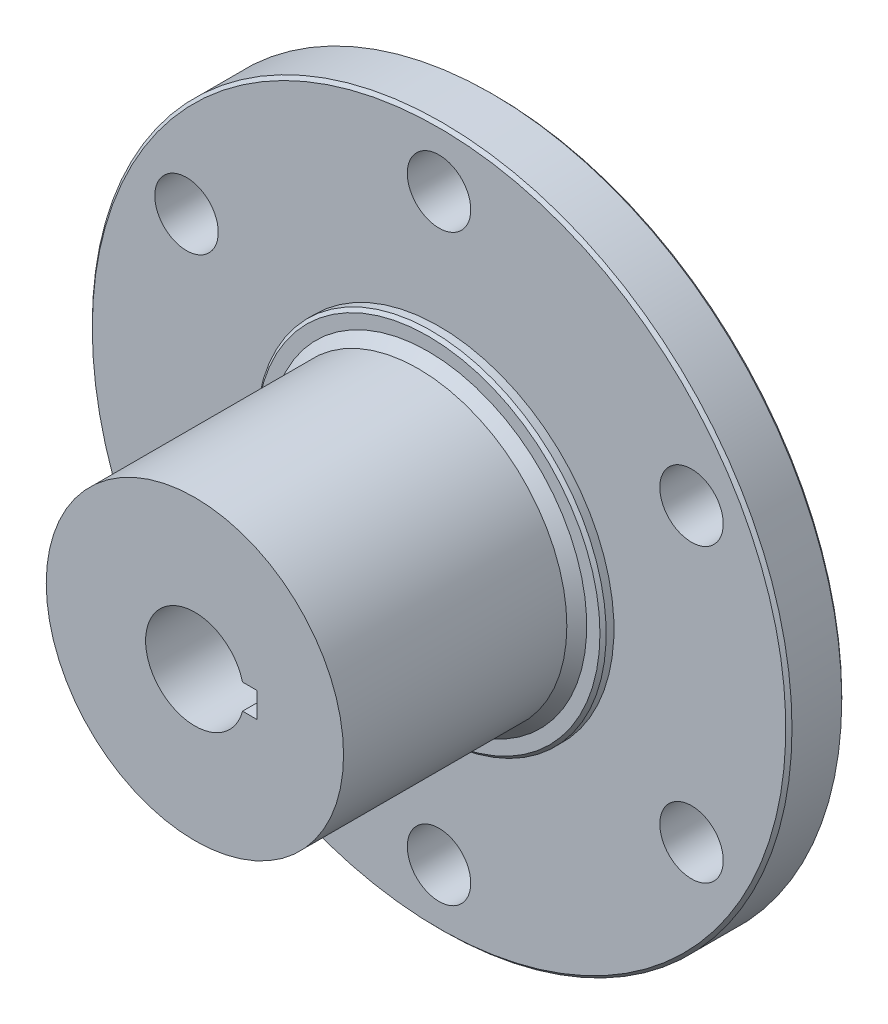
ISO-10303-21;
HEADER;
FILE_DESCRIPTION(('STEP AP214'),'2;1');
FILE_NAME('part.step','',(''),(''),'','','');
FILE_SCHEMA(('AUTOMOTIVE_DESIGN { 1 0 10303 214 1 1 1 1 }'));
ENDSEC;
DATA;
#1=APPLICATION_CONTEXT('core data for automotive mechanical design processes');
#2=APPLICATION_PROTOCOL_DEFINITION('international standard','automotive_design',2000,#1);
#3=PRODUCT_CONTEXT('',#1,'mechanical');
#4=PRODUCT('Part','Part','',(#3));
#5=PRODUCT_RELATED_PRODUCT_CATEGORY('part','',(#4));
#6=PRODUCT_DEFINITION_FORMATION('','',#4);
#7=PRODUCT_DEFINITION_CONTEXT('part definition',#1,'design');
#8=PRODUCT_DEFINITION('design','',#6,#7);
#9=PRODUCT_DEFINITION_SHAPE('','',#8);
#10=(LENGTH_UNIT() NAMED_UNIT(*) SI_UNIT(.MILLI.,.METRE.));
#11=(NAMED_UNIT(*) PLANE_ANGLE_UNIT() SI_UNIT($,.RADIAN.));
#12=(NAMED_UNIT(*) SI_UNIT($,.STERADIAN.) SOLID_ANGLE_UNIT());
#13=UNCERTAINTY_MEASURE_WITH_UNIT(LENGTH_MEASURE(1.E-05),#10,'distance_accuracy_value','');
#14=(GEOMETRIC_REPRESENTATION_CONTEXT(3) GLOBAL_UNCERTAINTY_ASSIGNED_CONTEXT((#13)) GLOBAL_UNIT_ASSIGNED_CONTEXT((#10,
#11,#12)) REPRESENTATION_CONTEXT('',''));
#15=CARTESIAN_POINT('',(0.,0.,0.));
#16=DIRECTION('',(0.,0.,1.));
#17=DIRECTION('',(1.,0.,0.));
#18=AXIS2_PLACEMENT_3D('',#15,#16,#17);
#19=CARTESIAN_POINT('',(3.89225476041844,-1.0287,0.));
#20=DIRECTION('',(0.,-1.,0.));
#21=DIRECTION('',(1.,0.,0.));
#22=AXIS2_PLACEMENT_3D('',#19,#20,#21);
#23=PLANE('',#22);
#24=DIRECTION('',(0.,0.,-1.));
#25=VECTOR('',#24,1.);
#26=CARTESIAN_POINT('',(5.0546,-1.0287,0.));
#27=LINE('',#26,#25);
#28=CARTESIAN_POINT('',(5.0546,-1.0287,25.4));
#29=VERTEX_POINT('',#28);
#30=CARTESIAN_POINT('',(5.0546,-1.0287,0.));
#31=VERTEX_POINT('',#30);
#32=EDGE_CURVE('E77',#29,#31,#27,.T.);
#33=ORIENTED_EDGE('',*,*,#32,.T.);
#34=DIRECTION('',(1.,0.,0.));
#35=VECTOR('',#34,1.);
#36=CARTESIAN_POINT('',(3.89225476041844,-1.0287,0.));
#37=LINE('',#36,#35);
#38=CARTESIAN_POINT('',(3.89225476041844,-1.0287,0.));
#39=VERTEX_POINT('',#38);
#40=EDGE_CURVE('E34',#39,#31,#37,.T.);
#41=ORIENTED_EDGE('',*,*,#40,.F.);
#42=DIRECTION('',(0.,0.,1.));
#43=VECTOR('',#42,1.);
#44=CARTESIAN_POINT('',(3.89225476041844,-1.0287,0.));
#45=LINE('',#44,#43);
#46=CARTESIAN_POINT('',(3.89225476041844,-1.0287,25.4));
#47=VERTEX_POINT('',#46);
#48=EDGE_CURVE('E66',#39,#47,#45,.T.);
#49=ORIENTED_EDGE('',*,*,#48,.T.);
#50=DIRECTION('',(1.,0.,0.));
#51=VECTOR('',#50,1.);
#52=CARTESIAN_POINT('',(0.,-1.0287,25.4));
#53=LINE('',#52,#51);
#54=EDGE_CURVE('E52',#29,#47,#53,.F.);
#55=ORIENTED_EDGE('',*,*,#54,.F.);
#56=EDGE_LOOP('',(#33,#41,#49,#55));
#57=FACE_BOUND('',#56,.T.);
#58=ADVANCED_FACE('F16',(#57),#23,.F.);
#59=CARTESIAN_POINT('',(3.89225476041844,1.0287,0.));
#60=DIRECTION('',(0.,1.,0.));
#61=DIRECTION('',(0.,0.,1.));
#62=AXIS2_PLACEMENT_3D('',#59,#60,#61);
#63=PLANE('',#62);
#64=DIRECTION('',(0.,0.,1.));
#65=VECTOR('',#64,1.);
#66=CARTESIAN_POINT('',(3.89225476041844,1.0287,0.));
#67=LINE('',#66,#65);
#68=CARTESIAN_POINT('',(3.89225476041844,1.0287,25.4));
#69=VERTEX_POINT('',#68);
#70=CARTESIAN_POINT('',(3.89225476041844,1.0287,0.));
#71=VERTEX_POINT('',#70);
#72=EDGE_CURVE('E59',#69,#71,#67,.F.);
#73=ORIENTED_EDGE('',*,*,#72,.T.);
#74=DIRECTION('',(1.,0.,0.));
#75=VECTOR('',#74,1.);
#76=CARTESIAN_POINT('',(3.89225476041844,1.0287,0.));
#77=LINE('',#76,#75);
#78=CARTESIAN_POINT('',(5.0546,1.0287,0.));
#79=VERTEX_POINT('',#78);
#80=EDGE_CURVE('E84',#79,#71,#77,.F.);
#81=ORIENTED_EDGE('',*,*,#80,.F.);
#82=DIRECTION('',(0.,0.,-1.));
#83=VECTOR('',#82,1.);
#84=CARTESIAN_POINT('',(5.0546,1.0287,0.));
#85=LINE('',#84,#83);
#86=CARTESIAN_POINT('',(5.0546,1.0287,25.4));
#87=VERTEX_POINT('',#86);
#88=EDGE_CURVE('E73',#79,#87,#85,.F.);
#89=ORIENTED_EDGE('',*,*,#88,.T.);
#90=DIRECTION('',(1.,0.,0.));
#91=VECTOR('',#90,1.);
#92=CARTESIAN_POINT('',(0.,1.0287,25.4));
#93=LINE('',#92,#91);
#94=EDGE_CURVE('E67',#69,#87,#93,.T.);
#95=ORIENTED_EDGE('',*,*,#94,.F.);
#96=EDGE_LOOP('',(#73,#81,#89,#95));
#97=FACE_BOUND('',#96,.T.);
#98=ADVANCED_FACE('F71',(#97),#63,.F.);
#99=CARTESIAN_POINT('',(0.,0.,25.4));
#100=DIRECTION('',(0.,0.,1.));
#101=DIRECTION('',(1.,0.,0.));
#102=AXIS2_PLACEMENT_3D('',#99,#100,#101);
#103=PLANE('',#102);
#104=CARTESIAN_POINT('',(0.,0.,25.4));
#105=DIRECTION('',(0.,0.,-1.));
#106=DIRECTION('',(-1.,0.,0.));
#107=AXIS2_PLACEMENT_3D('',#104,#105,#106);
#108=CIRCLE('',#107,12.1412);
#109=CARTESIAN_POINT('',(-12.1412,0.,25.4));
#110=VERTEX_POINT('',#109);
#111=EDGE_CURVE('E89',#110,#110,#108,.T.);
#112=ORIENTED_EDGE('',*,*,#111,.F.);
#113=EDGE_LOOP('',(#112));
#114=FACE_BOUND('',#113,.T.);
#115=CARTESIAN_POINT('',(0.,0.,25.4));
#116=DIRECTION('',(0.,0.,1.));
#117=DIRECTION('',(1.,0.,0.));
#118=AXIS2_PLACEMENT_3D('',#115,#116,#117);
#119=CIRCLE('',#118,4.0259);
#120=EDGE_CURVE('E19',#47,#69,#119,.F.);
#121=ORIENTED_EDGE('',*,*,#120,.T.);
#122=ORIENTED_EDGE('',*,*,#94,.T.);
#123=DIRECTION('',(0.,1.,0.));
#124=VECTOR('',#123,1.);
#125=CARTESIAN_POINT('',(5.0546,1.0287,25.4));
#126=LINE('',#125,#124);
#127=EDGE_CURVE('E87',#87,#29,#126,.F.);
#128=ORIENTED_EDGE('',*,*,#127,.T.);
#129=ORIENTED_EDGE('',*,*,#54,.T.);
#130=EDGE_LOOP('',(#121,#122,#128,#129));
#131=FACE_BOUND('',#130,.T.);
#132=ADVANCED_FACE('F76',(#114,#131),#103,.T.);
#133=CARTESIAN_POINT('',(0.,0.,0.));
#134=DIRECTION('',(0.,0.,1.));
#135=DIRECTION('',(1.,0.,0.));
#136=AXIS2_PLACEMENT_3D('',#133,#134,#135);
#137=CYLINDRICAL_SURFACE('',#136,4.0259);
#138=ORIENTED_EDGE('',*,*,#48,.F.);
#139=CARTESIAN_POINT('',(0.,0.,0.));
#140=DIRECTION('',(0.,0.,1.));
#141=DIRECTION('',(1.,0.,0.));
#142=AXIS2_PLACEMENT_3D('',#139,#140,#141);
#143=CIRCLE('',#142,4.0259);
#144=EDGE_CURVE('E64',#39,#71,#143,.F.);
#145=ORIENTED_EDGE('',*,*,#144,.T.);
#146=ORIENTED_EDGE('',*,*,#72,.F.);
#147=ORIENTED_EDGE('',*,*,#120,.F.);
#148=EDGE_LOOP('',(#138,#145,#146,#147));
#149=FACE_BOUND('',#148,.T.);
#150=ADVANCED_FACE('F62',(#149),#137,.F.);
#151=CARTESIAN_POINT('',(5.0546,1.0287,0.));
#152=DIRECTION('',(1.,0.,0.));
#153=DIRECTION('',(0.,0.,-1.));
#154=AXIS2_PLACEMENT_3D('',#151,#152,#153);
#155=PLANE('',#154);
#156=ORIENTED_EDGE('',*,*,#88,.F.);
#157=DIRECTION('',(0.,1.,0.));
#158=VECTOR('',#157,1.);
#159=CARTESIAN_POINT('',(5.0546,0.,0.));
#160=LINE('',#159,#158);
#161=EDGE_CURVE('E91',#79,#31,#160,.F.);
#162=ORIENTED_EDGE('',*,*,#161,.T.);
#163=ORIENTED_EDGE('',*,*,#32,.F.);
#164=ORIENTED_EDGE('',*,*,#127,.F.);
#165=EDGE_LOOP('',(#156,#162,#163,#164));
#166=FACE_BOUND('',#165,.T.);
#167=ADVANCED_FACE('F165',(#166),#155,.F.);
#168=CARTESIAN_POINT('',(0.,0.,25.4));
#169=DIRECTION('',(0.,0.,-1.));
#170=DIRECTION('',(-1.,0.,0.));
#171=AXIS2_PLACEMENT_3D('',#168,#169,#170);
#172=CYLINDRICAL_SURFACE('',#171,12.1412);
#173=ORIENTED_EDGE('',*,*,#111,.T.);
#174=EDGE_LOOP('',(#173));
#175=FACE_BOUND('',#174,.T.);
#176=CARTESIAN_POINT('',(0.,0.,7.16280000000005));
#177=DIRECTION('',(0.,0.,-1.));
#178=DIRECTION('',(-1.,0.,0.));
#179=AXIS2_PLACEMENT_3D('',#176,#177,#178);
#180=CIRCLE('',#179,12.1412);
#181=CARTESIAN_POINT('',(-12.1412,0.,7.16280000000005));
#182=VERTEX_POINT('',#181);
#183=EDGE_CURVE('E93',#182,#182,#180,.T.);
#184=ORIENTED_EDGE('',*,*,#183,.F.);
#185=EDGE_LOOP('',(#184));
#186=FACE_BOUND('',#185,.T.);
#187=ADVANCED_FACE('F155',(#175,#186),#172,.T.);
#188=CARTESIAN_POINT('',(0.,0.,0.));
#189=DIRECTION('',(0.,0.,1.));
#190=DIRECTION('',(1.,0.,0.));
#191=AXIS2_PLACEMENT_3D('',#188,#189,#190);
#192=PLANE('',#191);
#193=ORIENTED_EDGE('',*,*,#161,.F.);
#194=ORIENTED_EDGE('',*,*,#80,.T.);
#195=ORIENTED_EDGE('',*,*,#144,.F.);
#196=ORIENTED_EDGE('',*,*,#40,.T.);
#197=EDGE_LOOP('',(#193,#194,#195,#196));
#198=FACE_BOUND('',#197,.T.);
#199=CARTESIAN_POINT('',(0.,0.,0.));
#200=DIRECTION('',(0.,0.,1.));
#201=DIRECTION('',(0.,-1.,0.));
#202=AXIS2_PLACEMENT_3D('',#199,#200,#201);
#203=CIRCLE('',#202,14.1003226197908);
#204=CARTESIAN_POINT('',(0.,-14.1003226197908,0.));
#205=VERTEX_POINT('',#204);
#206=EDGE_CURVE('E149',#205,#205,#203,.T.);
#207=ORIENTED_EDGE('',*,*,#206,.F.);
#208=EDGE_LOOP('',(#207));
#209=FACE_BOUND('',#208,.T.);
#210=ADVANCED_FACE('F239',(#198,#209),#192,.F.);
#211=CARTESIAN_POINT('',(0.,0.,6.35));
#212=DIRECTION('',(0.,0.,-1.));
#213=DIRECTION('',(0.,1.,0.));
#214=AXIS2_PLACEMENT_3D('',#211,#212,#213);
#215=CONICAL_SURFACE('',#214,12.954,0.785398163397445);
#216=ORIENTED_EDGE('',*,*,#183,.T.);
#217=EDGE_LOOP('',(#216));
#218=FACE_BOUND('',#217,.T.);
#219=CARTESIAN_POINT('',(0.,0.,6.35));
#220=DIRECTION('',(0.,0.,-1.));
#221=DIRECTION('',(0.,1.,0.));
#222=AXIS2_PLACEMENT_3D('',#219,#220,#221);
#223=CIRCLE('',#222,12.954);
#224=CARTESIAN_POINT('',(0.,12.954,6.35));
#225=VERTEX_POINT('',#224);
#226=EDGE_CURVE('E145',#225,#225,#223,.T.);
#227=ORIENTED_EDGE('',*,*,#226,.F.);
#228=EDGE_LOOP('',(#227));
#229=FACE_BOUND('',#228,.T.);
#230=ADVANCED_FACE('F235',(#218,#229),#215,.T.);
#231=CARTESIAN_POINT('',(0.,0.,0.254000000000009));
#232=DIRECTION('',(0.,0.,1.));
#233=DIRECTION('',(0.,-1.,0.));
#234=AXIS2_PLACEMENT_3D('',#231,#232,#233);
#235=CONICAL_SURFACE('',#234,14.3543226197908,0.785398163397449);
#236=ORIENTED_EDGE('',*,*,#206,.T.);
#237=EDGE_LOOP('',(#236));
#238=FACE_BOUND('',#237,.T.);
#239=CARTESIAN_POINT('',(0.,0.,0.254000000000009));
#240=DIRECTION('',(0.,0.,-1.));
#241=DIRECTION('',(-1.,0.,0.));
#242=AXIS2_PLACEMENT_3D('',#239,#240,#241);
#243=CIRCLE('',#242,14.3543226197908);
#244=CARTESIAN_POINT('',(-14.3543226197908,0.,0.254000000000009));
#245=VERTEX_POINT('',#244);
#246=EDGE_CURVE('E148',#245,#245,#243,.F.);
#247=ORIENTED_EDGE('',*,*,#246,.F.);
#248=EDGE_LOOP('',(#247));
#249=FACE_BOUND('',#248,.T.);
#250=ADVANCED_FACE('F231',(#238,#249),#235,.T.);
#251=CARTESIAN_POINT('',(0.,0.,6.35));
#252=DIRECTION('',(0.,0.,1.));
#253=DIRECTION('',(1.,0.,0.));
#254=AXIS2_PLACEMENT_3D('',#251,#252,#253);
#255=PLANE('',#254);
#256=CARTESIAN_POINT('',(0.,0.,6.35));
#257=DIRECTION('',(0.,0.,-1.));
#258=DIRECTION('',(-1.,0.,0.));
#259=AXIS2_PLACEMENT_3D('',#256,#257,#258);
#260=CIRCLE('',#259,14.0335);
#261=CARTESIAN_POINT('',(-14.0335,0.,6.35));
#262=VERTEX_POINT('',#261);
#263=EDGE_CURVE('E141',#262,#262,#260,.T.);
#264=ORIENTED_EDGE('',*,*,#263,.F.);
#265=EDGE_LOOP('',(#264));
#266=FACE_BOUND('',#265,.T.);
#267=ORIENTED_EDGE('',*,*,#226,.T.);
#268=EDGE_LOOP('',(#267));
#269=FACE_BOUND('',#268,.T.);
#270=ADVANCED_FACE('F227',(#266,#269),#255,.T.);
#271=CARTESIAN_POINT('',(0.,0.,1.143));
#272=DIRECTION('',(0.,0.,1.));
#273=DIRECTION('',(1.,0.,0.));
#274=AXIS2_PLACEMENT_3D('',#271,#272,#273);
#275=CONICAL_SURFACE('',#274,28.575,0.785398163397457);
#276=CARTESIAN_POINT('',(0.,0.,1.14299999999999));
#277=DIRECTION('',(0.,0.,-1.));
#278=DIRECTION('',(-1.,0.,0.));
#279=AXIS2_PLACEMENT_3D('',#276,#277,#278);
#280=CIRCLE('',#279,28.575);
#281=CARTESIAN_POINT('',(-28.575,0.,1.14299999999999));
#282=VERTEX_POINT('',#281);
#283=EDGE_CURVE('E144',#282,#282,#280,.F.);
#284=ORIENTED_EDGE('',*,*,#283,.F.);
#285=EDGE_LOOP('',(#284));
#286=FACE_BOUND('',#285,.T.);
#287=CARTESIAN_POINT('',(0.,0.,0.889000000000003));
#288=DIRECTION('',(0.,0.,1.));
#289=DIRECTION('',(1.,0.,0.));
#290=AXIS2_PLACEMENT_3D('',#287,#288,#289);
#291=CIRCLE('',#290,28.321);
#292=CARTESIAN_POINT('',(28.321,0.,0.889000000000003));
#293=VERTEX_POINT('',#292);
#294=EDGE_CURVE('E138',#293,#293,#291,.F.);
#295=ORIENTED_EDGE('',*,*,#294,.F.);
#296=EDGE_LOOP('',(#295));
#297=FACE_BOUND('',#296,.T.);
#298=ADVANCED_FACE('F223',(#286,#297),#275,.T.);
#299=CARTESIAN_POINT('',(0.,0.,0.));
#300=DIRECTION('',(0.,0.,-1.));
#301=DIRECTION('',(-1.,0.,0.));
#302=AXIS2_PLACEMENT_3D('',#299,#300,#301);
#303=CYLINDRICAL_SURFACE('',#302,14.3543226197908);
#304=CARTESIAN_POINT('',(0.,0.,0.889000000000001));
#305=DIRECTION('',(0.,0.,-1.));
#306=DIRECTION('',(-1.,0.,0.));
#307=AXIS2_PLACEMENT_3D('',#304,#305,#306);
#308=CIRCLE('',#307,14.3543226197908);
#309=CARTESIAN_POINT('',(-14.3543226197908,0.,0.889000000000001));
#310=VERTEX_POINT('',#309);
#311=EDGE_CURVE('E135',#310,#310,#308,.F.);
#312=ORIENTED_EDGE('',*,*,#311,.F.);
#313=EDGE_LOOP('',(#312));
#314=FACE_BOUND('',#313,.T.);
#315=ORIENTED_EDGE('',*,*,#246,.T.);
#316=EDGE_LOOP('',(#315));
#317=FACE_BOUND('',#316,.T.);
#318=ADVANCED_FACE('F219',(#314,#317),#303,.T.);
#319=CARTESIAN_POINT('',(0.,0.,6.35));
#320=DIRECTION('',(0.,0.,-1.));
#321=DIRECTION('',(-1.,0.,0.));
#322=AXIS2_PLACEMENT_3D('',#319,#320,#321);
#323=CYLINDRICAL_SURFACE('',#322,28.575);
#324=CARTESIAN_POINT('',(0.,0.,5.20699999999999));
#325=DIRECTION('',(0.,0.,-1.));
#326=DIRECTION('',(-1.,0.,0.));
#327=AXIS2_PLACEMENT_3D('',#324,#325,#326);
#328=CIRCLE('',#327,28.575);
#329=CARTESIAN_POINT('',(-28.575,0.,5.20699999999999));
#330=VERTEX_POINT('',#329);
#331=EDGE_CURVE('E134',#330,#330,#328,.F.);
#332=ORIENTED_EDGE('',*,*,#331,.F.);
#333=EDGE_LOOP('',(#332));
#334=FACE_BOUND('',#333,.T.);
#335=ORIENTED_EDGE('',*,*,#283,.T.);
#336=EDGE_LOOP('',(#335));
#337=FACE_BOUND('',#336,.T.);
#338=ADVANCED_FACE('F215',(#334,#337),#323,.T.);
#339=CARTESIAN_POINT('',(0.,0.,6.09599999999999));
#340=DIRECTION('',(0.,0.,-1.));
#341=DIRECTION('',(-1.,0.,0.));
#342=AXIS2_PLACEMENT_3D('',#339,#340,#341);
#343=CONICAL_SURFACE('',#342,14.2875,0.785398163397421);
#344=CARTESIAN_POINT('',(0.,0.,6.09599999999999));
#345=DIRECTION('',(0.,0.,-1.));
#346=DIRECTION('',(-1.,0.,0.));
#347=AXIS2_PLACEMENT_3D('',#344,#345,#346);
#348=CIRCLE('',#347,14.2875);
#349=CARTESIAN_POINT('',(-14.2875,0.,6.09599999999999));
#350=VERTEX_POINT('',#349);
#351=EDGE_CURVE('E124',#350,#350,#348,.T.);
#352=ORIENTED_EDGE('',*,*,#351,.F.);
#353=EDGE_LOOP('',(#352));
#354=FACE_BOUND('',#353,.T.);
#355=ORIENTED_EDGE('',*,*,#263,.T.);
#356=EDGE_LOOP('',(#355));
#357=FACE_BOUND('',#356,.T.);
#358=ADVANCED_FACE('F211',(#354,#357),#343,.T.);
#359=CARTESIAN_POINT('',(-62.1712615480534,0.,0.889000000000003));
#360=DIRECTION('',(0.,0.,-1.));
#361=DIRECTION('',(-1.,0.,0.));
#362=AXIS2_PLACEMENT_3D('',#359,#360,#361);
#363=PLANE('',#362);
#364=CARTESIAN_POINT('',(-20.622229927617,11.90625,0.889000000000001));
#365=DIRECTION('',(0.,0.,1.));
#366=DIRECTION('',(1.,0.,0.));
#367=AXIS2_PLACEMENT_3D('',#364,#365,#366);
#368=CIRCLE('',#367,2.5908);
#369=CARTESIAN_POINT('',(-18.031429927617,11.90625,0.889000000000001));
#370=VERTEX_POINT('',#369);
#371=EDGE_CURVE('E115',#370,#370,#368,.T.);
#372=ORIENTED_EDGE('',*,*,#371,.T.);
#373=EDGE_LOOP('',(#372));
#374=FACE_BOUND('',#373,.T.);
#375=CARTESIAN_POINT('',(0.,-23.8125,0.889000000000003));
#376=DIRECTION('',(0.,0.,1.));
#377=DIRECTION('',(1.,0.,0.));
#378=AXIS2_PLACEMENT_3D('',#375,#376,#377);
#379=CIRCLE('',#378,2.5908);
#380=CARTESIAN_POINT('',(2.5908,-23.8125,0.889000000000003));
#381=VERTEX_POINT('',#380);
#382=EDGE_CURVE('E118',#381,#381,#379,.T.);
#383=ORIENTED_EDGE('',*,*,#382,.T.);
#384=EDGE_LOOP('',(#383));
#385=FACE_BOUND('',#384,.T.);
#386=CARTESIAN_POINT('',(20.6222299276168,11.9062500000002,0.889000000000004));
#387=DIRECTION('',(0.,0.,1.));
#388=DIRECTION('',(1.,0.,0.));
#389=AXIS2_PLACEMENT_3D('',#386,#387,#388);
#390=CIRCLE('',#389,2.5908);
#391=CARTESIAN_POINT('',(23.2130299276168,11.9062500000002,0.889000000000004));
#392=VERTEX_POINT('',#391);
#393=EDGE_CURVE('E121',#392,#392,#390,.T.);
#394=ORIENTED_EDGE('',*,*,#393,.T.);
#395=EDGE_LOOP('',(#394));
#396=FACE_BOUND('',#395,.T.);
#397=ORIENTED_EDGE('',*,*,#311,.T.);
#398=EDGE_LOOP('',(#397));
#399=FACE_BOUND('',#398,.T.);
#400=CARTESIAN_POINT('',(20.6222299276171,-11.9062499999998,0.889000000000004));
#401=DIRECTION('',(0.,0.,1.));
#402=DIRECTION('',(1.,0.,0.));
#403=AXIS2_PLACEMENT_3D('',#400,#401,#402);
#404=CIRCLE('',#403,2.5908);
#405=CARTESIAN_POINT('',(23.2130299276171,-11.9062499999998,0.889000000000004));
#406=VERTEX_POINT('',#405);
#407=EDGE_CURVE('E125',#406,#406,#404,.T.);
#408=ORIENTED_EDGE('',*,*,#407,.T.);
#409=EDGE_LOOP('',(#408));
#410=FACE_BOUND('',#409,.T.);
#411=CARTESIAN_POINT('',(-20.6222299276169,-11.9062500000001,0.889000000000001));
#412=DIRECTION('',(0.,0.,1.));
#413=DIRECTION('',(1.,0.,0.));
#414=AXIS2_PLACEMENT_3D('',#411,#412,#413);
#415=CIRCLE('',#414,2.5908);
#416=CARTESIAN_POINT('',(-18.0314299276169,-11.9062500000001,0.889000000000001));
#417=VERTEX_POINT('',#416);
#418=EDGE_CURVE('E128',#417,#417,#415,.T.);
#419=ORIENTED_EDGE('',*,*,#418,.T.);
#420=EDGE_LOOP('',(#419));
#421=FACE_BOUND('',#420,.T.);
#422=CARTESIAN_POINT('',(0.,23.8125,0.889000000000003));
#423=DIRECTION('',(0.,0.,1.));
#424=DIRECTION('',(1.,0.,0.));
#425=AXIS2_PLACEMENT_3D('',#422,#423,#424);
#426=CIRCLE('',#425,2.5908);
#427=CARTESIAN_POINT('',(2.5908,23.8125,0.889000000000003));
#428=VERTEX_POINT('',#427);
#429=EDGE_CURVE('E131',#428,#428,#426,.T.);
#430=ORIENTED_EDGE('',*,*,#429,.T.);
#431=EDGE_LOOP('',(#430));
#432=FACE_BOUND('',#431,.T.);
#433=ORIENTED_EDGE('',*,*,#294,.T.);
#434=EDGE_LOOP('',(#433));
#435=FACE_BOUND('',#434,.T.);
#436=ADVANCED_FACE('F207',(#374,#385,#396,#399,#410,#421,#432,#435),#363,.T.);
#437=CARTESIAN_POINT('',(0.,0.,5.20699999999999));
#438=DIRECTION('',(0.,0.,-1.));
#439=DIRECTION('',(-1.,0.,0.));
#440=AXIS2_PLACEMENT_3D('',#437,#438,#439);
#441=CONICAL_SURFACE('',#440,28.575,0.785398163397457);
#442=CARTESIAN_POINT('',(0.,0.,5.461));
#443=DIRECTION('',(0.,0.,-1.));
#444=DIRECTION('',(-1.,0.,0.));
#445=AXIS2_PLACEMENT_3D('',#442,#443,#444);
#446=CIRCLE('',#445,28.321);
#447=CARTESIAN_POINT('',(-28.321,0.,5.461));
#448=VERTEX_POINT('',#447);
#449=EDGE_CURVE('E112',#448,#448,#446,.T.);
#450=ORIENTED_EDGE('',*,*,#449,.T.);
#451=EDGE_LOOP('',(#450));
#452=FACE_BOUND('',#451,.T.);
#453=ORIENTED_EDGE('',*,*,#331,.T.);
#454=EDGE_LOOP('',(#453));
#455=FACE_BOUND('',#454,.T.);
#456=ADVANCED_FACE('F203',(#452,#455),#441,.T.);
#457=CARTESIAN_POINT('',(0.,23.8125,0.));
#458=DIRECTION('',(0.,0.,1.));
#459=DIRECTION('',(1.,0.,0.));
#460=AXIS2_PLACEMENT_3D('',#457,#458,#459);
#461=CYLINDRICAL_SURFACE('',#460,2.5908);
#462=ORIENTED_EDGE('',*,*,#429,.F.);
#463=EDGE_LOOP('',(#462));
#464=FACE_BOUND('',#463,.T.);
#465=CARTESIAN_POINT('',(0.,23.8125,5.461));
#466=DIRECTION('',(0.,0.,1.));
#467=DIRECTION('',(1.,0.,0.));
#468=AXIS2_PLACEMENT_3D('',#465,#466,#467);
#469=CIRCLE('',#468,2.5908);
#470=CARTESIAN_POINT('',(2.5908,23.8125,5.461));
#471=VERTEX_POINT('',#470);
#472=EDGE_CURVE('E109',#471,#471,#469,.T.);
#473=ORIENTED_EDGE('',*,*,#472,.T.);
#474=EDGE_LOOP('',(#473));
#475=FACE_BOUND('',#474,.T.);
#476=ADVANCED_FACE('F199',(#464,#475),#461,.F.);
#477=CARTESIAN_POINT('',(-20.6222299276169,-11.9062500000001,0.));
#478=DIRECTION('',(0.,0.,1.));
#479=DIRECTION('',(1.,0.,0.));
#480=AXIS2_PLACEMENT_3D('',#477,#478,#479);
#481=CYLINDRICAL_SURFACE('',#480,2.5908);
#482=ORIENTED_EDGE('',*,*,#418,.F.);
#483=EDGE_LOOP('',(#482));
#484=FACE_BOUND('',#483,.T.);
#485=CARTESIAN_POINT('',(-20.6222299276169,-11.9062500000001,5.461));
#486=DIRECTION('',(0.,0.,1.));
#487=DIRECTION('',(1.,0.,0.));
#488=AXIS2_PLACEMENT_3D('',#485,#486,#487);
#489=CIRCLE('',#488,2.5908);
#490=CARTESIAN_POINT('',(-18.0314299276169,-11.9062500000001,5.461));
#491=VERTEX_POINT('',#490);
#492=EDGE_CURVE('E106',#491,#491,#489,.T.);
#493=ORIENTED_EDGE('',*,*,#492,.T.);
#494=EDGE_LOOP('',(#493));
#495=FACE_BOUND('',#494,.T.);
#496=ADVANCED_FACE('F195',(#484,#495),#481,.F.);
#497=CARTESIAN_POINT('',(20.6222299276171,-11.9062499999998,0.));
#498=DIRECTION('',(0.,0.,1.));
#499=DIRECTION('',(1.,0.,0.));
#500=AXIS2_PLACEMENT_3D('',#497,#498,#499);
#501=CYLINDRICAL_SURFACE('',#500,2.5908);
#502=ORIENTED_EDGE('',*,*,#407,.F.);
#503=EDGE_LOOP('',(#502));
#504=FACE_BOUND('',#503,.T.);
#505=CARTESIAN_POINT('',(20.6222299276171,-11.9062499999998,5.461));
#506=DIRECTION('',(0.,0.,1.));
#507=DIRECTION('',(1.,0.,0.));
#508=AXIS2_PLACEMENT_3D('',#505,#506,#507);
#509=CIRCLE('',#508,2.5908);
#510=CARTESIAN_POINT('',(23.2130299276171,-11.9062499999998,5.461));
#511=VERTEX_POINT('',#510);
#512=EDGE_CURVE('E103',#511,#511,#509,.T.);
#513=ORIENTED_EDGE('',*,*,#512,.T.);
#514=EDGE_LOOP('',(#513));
#515=FACE_BOUND('',#514,.T.);
#516=ADVANCED_FACE('F191',(#504,#515),#501,.F.);
#517=CARTESIAN_POINT('',(0.,0.,0.));
#518=DIRECTION('',(0.,0.,-1.));
#519=DIRECTION('',(-1.,0.,0.));
#520=AXIS2_PLACEMENT_3D('',#517,#518,#519);
#521=CYLINDRICAL_SURFACE('',#520,14.2875);
#522=CARTESIAN_POINT('',(0.,0.,5.461));
#523=DIRECTION('',(0.,0.,-1.));
#524=DIRECTION('',(-1.,0.,0.));
#525=AXIS2_PLACEMENT_3D('',#522,#523,#524);
#526=CIRCLE('',#525,14.2875);
#527=CARTESIAN_POINT('',(-14.2875,0.,5.461));
#528=VERTEX_POINT('',#527);
#529=EDGE_CURVE('E100',#528,#528,#526,.F.);
#530=ORIENTED_EDGE('',*,*,#529,.T.);
#531=EDGE_LOOP('',(#530));
#532=FACE_BOUND('',#531,.T.);
#533=ORIENTED_EDGE('',*,*,#351,.T.);
#534=EDGE_LOOP('',(#533));
#535=FACE_BOUND('',#534,.T.);
#536=ADVANCED_FACE('F187',(#532,#535),#521,.T.);
#537=CARTESIAN_POINT('',(20.6222299276168,11.9062500000002,0.));
#538=DIRECTION('',(0.,0.,1.));
#539=DIRECTION('',(1.,0.,0.));
#540=AXIS2_PLACEMENT_3D('',#537,#538,#539);
#541=CYLINDRICAL_SURFACE('',#540,2.5908);
#542=ORIENTED_EDGE('',*,*,#393,.F.);
#543=EDGE_LOOP('',(#542));
#544=FACE_BOUND('',#543,.T.);
#545=CARTESIAN_POINT('',(20.6222299276168,11.9062500000002,5.461));
#546=DIRECTION('',(0.,0.,1.));
#547=DIRECTION('',(1.,0.,0.));
#548=AXIS2_PLACEMENT_3D('',#545,#546,#547);
#549=CIRCLE('',#548,2.5908);
#550=CARTESIAN_POINT('',(23.2130299276168,11.9062500000002,5.461));
#551=VERTEX_POINT('',#550);
#552=EDGE_CURVE('E97',#551,#551,#549,.T.);
#553=ORIENTED_EDGE('',*,*,#552,.T.);
#554=EDGE_LOOP('',(#553));
#555=FACE_BOUND('',#554,.T.);
#556=ADVANCED_FACE('F183',(#544,#555),#541,.F.);
#557=CARTESIAN_POINT('',(0.,-23.8125,0.));
#558=DIRECTION('',(0.,0.,1.));
#559=DIRECTION('',(1.,0.,0.));
#560=AXIS2_PLACEMENT_3D('',#557,#558,#559);
#561=CYLINDRICAL_SURFACE('',#560,2.5908);
#562=ORIENTED_EDGE('',*,*,#382,.F.);
#563=EDGE_LOOP('',(#562));
#564=FACE_BOUND('',#563,.T.);
#565=CARTESIAN_POINT('',(0.,-23.8125,5.461));
#566=DIRECTION('',(0.,0.,1.));
#567=DIRECTION('',(1.,0.,0.));
#568=AXIS2_PLACEMENT_3D('',#565,#566,#567);
#569=CIRCLE('',#568,2.5908);
#570=CARTESIAN_POINT('',(2.5908,-23.8125,5.461));
#571=VERTEX_POINT('',#570);
#572=EDGE_CURVE('E25',#571,#571,#569,.T.);
#573=ORIENTED_EDGE('',*,*,#572,.T.);
#574=EDGE_LOOP('',(#573));
#575=FACE_BOUND('',#574,.T.);
#576=ADVANCED_FACE('F175',(#564,#575),#561,.F.);
#577=CARTESIAN_POINT('',(-20.622229927617,11.90625,0.));
#578=DIRECTION('',(0.,0.,1.));
#579=DIRECTION('',(1.,0.,0.));
#580=AXIS2_PLACEMENT_3D('',#577,#578,#579);
#581=CYLINDRICAL_SURFACE('',#580,2.5908);
#582=ORIENTED_EDGE('',*,*,#371,.F.);
#583=EDGE_LOOP('',(#582));
#584=FACE_BOUND('',#583,.T.);
#585=CARTESIAN_POINT('',(-20.622229927617,11.90625,5.461));
#586=DIRECTION('',(0.,0.,1.));
#587=DIRECTION('',(1.,0.,0.));
#588=AXIS2_PLACEMENT_3D('',#585,#586,#587);
#589=CIRCLE('',#588,2.5908);
#590=CARTESIAN_POINT('',(-18.031429927617,11.90625,5.461));
#591=VERTEX_POINT('',#590);
#592=EDGE_CURVE('E11',#591,#591,#589,.T.);
#593=ORIENTED_EDGE('',*,*,#592,.T.);
#594=EDGE_LOOP('',(#593));
#595=FACE_BOUND('',#594,.T.);
#596=ADVANCED_FACE('F169',(#584,#595),#581,.F.);
#597=CARTESIAN_POINT('',(-62.1712615480534,0.,5.461));
#598=DIRECTION('',(0.,0.,-1.));
#599=DIRECTION('',(-1.,0.,0.));
#600=AXIS2_PLACEMENT_3D('',#597,#598,#599);
#601=PLANE('',#600);
#602=ORIENTED_EDGE('',*,*,#592,.F.);
#603=EDGE_LOOP('',(#602));
#604=FACE_BOUND('',#603,.T.);
#605=ORIENTED_EDGE('',*,*,#572,.F.);
#606=EDGE_LOOP('',(#605));
#607=FACE_BOUND('',#606,.T.);
#608=ORIENTED_EDGE('',*,*,#552,.F.);
#609=EDGE_LOOP('',(#608));
#610=FACE_BOUND('',#609,.T.);
#611=ORIENTED_EDGE('',*,*,#529,.F.);
#612=EDGE_LOOP('',(#611));
#613=FACE_BOUND('',#612,.T.);
#614=ORIENTED_EDGE('',*,*,#512,.F.);
#615=EDGE_LOOP('',(#614));
#616=FACE_BOUND('',#615,.T.);
#617=ORIENTED_EDGE('',*,*,#492,.F.);
#618=EDGE_LOOP('',(#617));
#619=FACE_BOUND('',#618,.T.);
#620=ORIENTED_EDGE('',*,*,#472,.F.);
#621=EDGE_LOOP('',(#620));
#622=FACE_BOUND('',#621,.T.);
#623=ORIENTED_EDGE('',*,*,#449,.F.);
#624=EDGE_LOOP('',(#623));
#625=FACE_BOUND('',#624,.T.);
#626=ADVANCED_FACE('F167',(#604,#607,#610,#613,#616,#619,#622,#625),#601,.F.);
#627=CLOSED_SHELL('',(#58,#98,#132,#150,#167,#187,#210,#230,#250,#270,#298,#318,#338,#358,#436,
#456,#476,#496,#516,#536,#556,#576,#596,#626));
#628=MANIFOLD_SOLID_BREP('B1',#627);
#629=ADVANCED_BREP_SHAPE_REPRESENTATION('',(#18,#628),#14);
#630=SHAPE_DEFINITION_REPRESENTATION(#9,#629);
ENDSEC;
END-ISO-10303-21;
